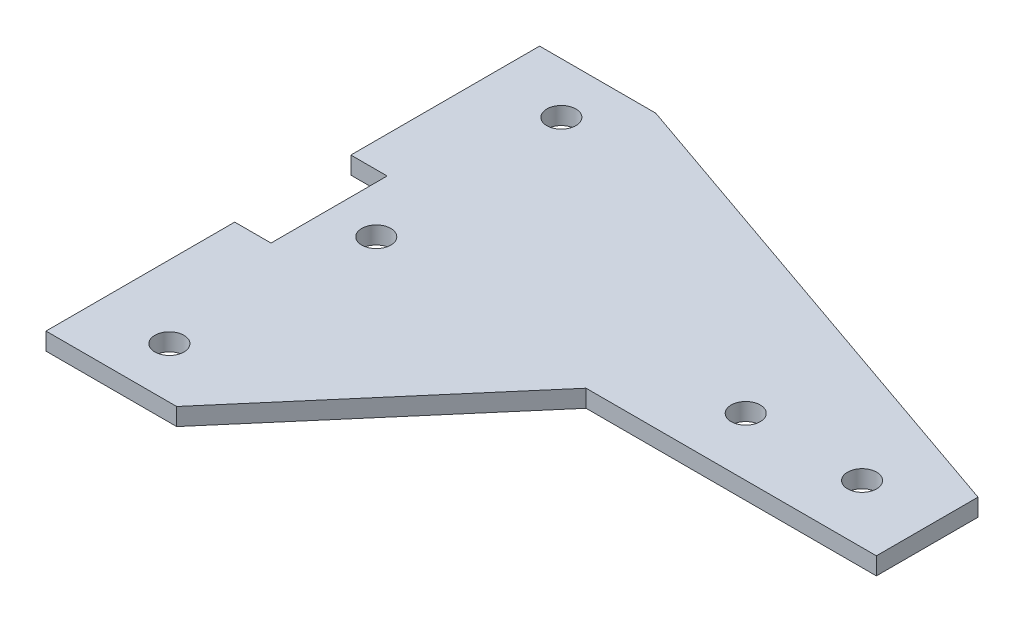
ISO-10303-21;
HEADER;
FILE_DESCRIPTION(('STEP AP214'),'2;1');
FILE_NAME('part.step','',(''),(''),'','','');
FILE_SCHEMA(('AUTOMOTIVE_DESIGN { 1 0 10303 214 1 1 1 1 }'));
ENDSEC;
DATA;
#1=APPLICATION_CONTEXT('core data for automotive mechanical design processes');
#2=APPLICATION_PROTOCOL_DEFINITION('international standard','automotive_design',2000,#1);
#3=PRODUCT_CONTEXT('',#1,'mechanical');
#4=PRODUCT('Part','Part','',(#3));
#5=PRODUCT_RELATED_PRODUCT_CATEGORY('part','',(#4));
#6=PRODUCT_DEFINITION_FORMATION('','',#4);
#7=PRODUCT_DEFINITION_CONTEXT('part definition',#1,'design');
#8=PRODUCT_DEFINITION('design','',#6,#7);
#9=PRODUCT_DEFINITION_SHAPE('','',#8);
#10=(LENGTH_UNIT() NAMED_UNIT(*) SI_UNIT(.MILLI.,.METRE.));
#11=(NAMED_UNIT(*) PLANE_ANGLE_UNIT() SI_UNIT($,.RADIAN.));
#12=(NAMED_UNIT(*) SI_UNIT($,.STERADIAN.) SOLID_ANGLE_UNIT());
#13=UNCERTAINTY_MEASURE_WITH_UNIT(LENGTH_MEASURE(1.E-05),#10,'distance_accuracy_value','');
#14=(GEOMETRIC_REPRESENTATION_CONTEXT(3) GLOBAL_UNCERTAINTY_ASSIGNED_CONTEXT((#13)) GLOBAL_UNIT_ASSIGNED_CONTEXT((#10,
#11,#12)) REPRESENTATION_CONTEXT('',''));
#15=CARTESIAN_POINT('',(0.,0.,0.));
#16=DIRECTION('',(0.,0.,1.));
#17=DIRECTION('',(1.,0.,0.));
#18=AXIS2_PLACEMENT_3D('',#15,#16,#17);
#19=CARTESIAN_POINT('',(0.,3.048,0.));
#20=DIRECTION('',(0.,-1.,0.));
#21=DIRECTION('',(0.,0.,-1.));
#22=AXIS2_PLACEMENT_3D('',#19,#20,#21);
#23=PLANE('',#22);
#24=DIRECTION('',(1.,0.,0.));
#25=VECTOR('',#24,1.);
#26=CARTESIAN_POINT('',(-6.35,3.048,-20.32));
#27=LINE('',#26,#25);
#28=CARTESIAN_POINT('',(-6.35,3.048,-20.32));
#29=VERTEX_POINT('',#28);
#30=CARTESIAN_POINT('',(0.,3.048,-20.32));
#31=VERTEX_POINT('',#30);
#32=EDGE_CURVE('E172',#29,#31,#27,.T.);
#33=ORIENTED_EDGE('',*,*,#32,.T.);
#34=DIRECTION('',(0.,0.,1.));
#35=VECTOR('',#34,1.);
#36=CARTESIAN_POINT('',(0.,3.048,-20.32));
#37=LINE('',#36,#35);
#38=CARTESIAN_POINT('',(0.,3.048,0.));
#39=VERTEX_POINT('',#38);
#40=EDGE_CURVE('E105',#31,#39,#37,.T.);
#41=ORIENTED_EDGE('',*,*,#40,.T.);
#42=DIRECTION('',(-1.,0.,0.));
#43=VECTOR('',#42,1.);
#44=CARTESIAN_POINT('',(0.,3.048,0.));
#45=LINE('',#44,#43);
#46=CARTESIAN_POINT('',(-6.35,3.048,0.));
#47=VERTEX_POINT('',#46);
#48=EDGE_CURVE('E196',#39,#47,#45,.T.);
#49=ORIENTED_EDGE('',*,*,#48,.T.);
#50=DIRECTION('',(0.,0.,1.));
#51=VECTOR('',#50,1.);
#52=CARTESIAN_POINT('',(-6.35,3.048,0.));
#53=LINE('',#52,#51);
#54=CARTESIAN_POINT('',(-6.34999999999999,3.048,33.02));
#55=VERTEX_POINT('',#54);
#56=EDGE_CURVE('E215',#47,#55,#53,.T.);
#57=ORIENTED_EDGE('',*,*,#56,.T.);
#58=DIRECTION('',(1.,0.,0.));
#59=VECTOR('',#58,1.);
#60=CARTESIAN_POINT('',(-6.34999999999999,3.048,33.02));
#61=LINE('',#60,#59);
#62=CARTESIAN_POINT('',(16.51,3.048,33.02));
#63=VERTEX_POINT('',#62);
#64=EDGE_CURVE('E212',#55,#63,#61,.T.);
#65=ORIENTED_EDGE('',*,*,#64,.T.);
#66=DIRECTION('',(0.650413169829219,0.,-0.759580613570875));
#67=VECTOR('',#66,1.);
#68=CARTESIAN_POINT('',(16.51,3.048,33.02));
#69=LINE('',#68,#67);
#70=CARTESIAN_POINT('',(49.5509890273243,3.048,-5.56669516940044));
#71=VERTEX_POINT('',#70);
#72=EDGE_CURVE('E214',#63,#71,#69,.T.);
#73=ORIENTED_EDGE('',*,*,#72,.T.);
#74=DIRECTION('',(1.,0.,0.));
#75=VECTOR('',#74,1.);
#76=CARTESIAN_POINT('',(49.5509890273243,3.048,-5.56669516940044));
#77=LINE('',#76,#75);
#78=CARTESIAN_POINT('',(100.350989027324,3.048,-5.56669516940044));
#79=VERTEX_POINT('',#78);
#80=EDGE_CURVE('E217',#71,#79,#77,.T.);
#81=ORIENTED_EDGE('',*,*,#80,.T.);
#82=DIRECTION('',(0.,0.,-1.));
#83=VECTOR('',#82,1.);
#84=CARTESIAN_POINT('',(100.350989027324,3.048,-5.56669516940044));
#85=LINE('',#84,#83);
#86=CARTESIAN_POINT('',(100.350989027324,3.048,-23.3466951694004));
#87=VERTEX_POINT('',#86);
#88=EDGE_CURVE('E133',#79,#87,#85,.T.);
#89=ORIENTED_EDGE('',*,*,#88,.T.);
#90=DIRECTION('',(-0.944673983238455,0.,-0.328010770238403));
#91=VECTOR('',#90,1.);
#92=CARTESIAN_POINT('',(13.97,3.048,-53.34));
#93=LINE('',#92,#91);
#94=CARTESIAN_POINT('',(13.97,3.048,-53.34));
#95=VERTEX_POINT('',#94);
#96=EDGE_CURVE('E127',#87,#95,#93,.T.);
#97=ORIENTED_EDGE('',*,*,#96,.T.);
#98=DIRECTION('',(-1.,0.,0.));
#99=VECTOR('',#98,1.);
#100=CARTESIAN_POINT('',(-6.35,3.048,-53.34));
#101=LINE('',#100,#99);
#102=CARTESIAN_POINT('',(-6.35,3.048,-53.34));
#103=VERTEX_POINT('',#102);
#104=EDGE_CURVE('E131',#95,#103,#101,.T.);
#105=ORIENTED_EDGE('',*,*,#104,.T.);
#106=DIRECTION('',(0.,0.,1.));
#107=VECTOR('',#106,1.);
#108=CARTESIAN_POINT('',(-6.35,3.048,-53.34));
#109=LINE('',#108,#107);
#110=EDGE_CURVE('E53',#103,#29,#109,.T.);
#111=ORIENTED_EDGE('',*,*,#110,.T.);
#112=EDGE_LOOP('',(#33,#41,#49,#57,#65,#73,#81,#89,#97,#105,#111));
#113=FACE_BOUND('',#112,.T.);
#114=CARTESIAN_POINT('',(87.6891837365436,3.048,-15.7266951694004));
#115=DIRECTION('',(0.,1.,0.));
#116=DIRECTION('',(0.,0.,1.));
#117=AXIS2_PLACEMENT_3D('',#114,#115,#116);
#118=CIRCLE('',#117,2.54);
#119=CARTESIAN_POINT('',(87.6891837365436,3.048,-13.1866951694004));
#120=VERTEX_POINT('',#119);
#121=EDGE_CURVE('E155',#120,#120,#118,.T.);
#122=ORIENTED_EDGE('',*,*,#121,.F.);
#123=EDGE_LOOP('',(#122));
#124=FACE_BOUND('',#123,.T.);
#125=CARTESIAN_POINT('',(8.255,3.048,-10.16));
#126=DIRECTION('',(0.,1.,0.));
#127=DIRECTION('',(0.,0.,1.));
#128=AXIS2_PLACEMENT_3D('',#125,#126,#127);
#129=CIRCLE('',#128,2.54);
#130=CARTESIAN_POINT('',(8.255,3.048,-7.62));
#131=VERTEX_POINT('',#130);
#132=EDGE_CURVE('E294',#131,#131,#129,.T.);
#133=ORIENTED_EDGE('',*,*,#132,.F.);
#134=EDGE_LOOP('',(#133));
#135=FACE_BOUND('',#134,.T.);
#136=CARTESIAN_POINT('',(6.35,3.048,24.13));
#137=DIRECTION('',(0.,1.,0.));
#138=DIRECTION('',(0.,0.,1.));
#139=AXIS2_PLACEMENT_3D('',#136,#137,#138);
#140=CIRCLE('',#139,2.54);
#141=CARTESIAN_POINT('',(6.35,3.048,26.67));
#142=VERTEX_POINT('',#141);
#143=EDGE_CURVE('E288',#142,#142,#140,.T.);
#144=ORIENTED_EDGE('',*,*,#143,.F.);
#145=EDGE_LOOP('',(#144));
#146=FACE_BOUND('',#145,.T.);
#147=CARTESIAN_POINT('',(6.34999999999999,3.048,-44.45));
#148=DIRECTION('',(0.,1.,0.));
#149=DIRECTION('',(0.,0.,1.));
#150=AXIS2_PLACEMENT_3D('',#147,#148,#149);
#151=CIRCLE('',#150,2.54);
#152=CARTESIAN_POINT('',(6.34999999999999,3.048,-41.91));
#153=VERTEX_POINT('',#152);
#154=EDGE_CURVE('E282',#153,#153,#151,.T.);
#155=ORIENTED_EDGE('',*,*,#154,.F.);
#156=EDGE_LOOP('',(#155));
#157=FACE_BOUND('',#156,.T.);
#158=CARTESIAN_POINT('',(67.3309890273243,3.048,-15.7266951694004));
#159=DIRECTION('',(0.,1.,0.));
#160=DIRECTION('',(0.,0.,1.));
#161=AXIS2_PLACEMENT_3D('',#158,#159,#160);
#162=CIRCLE('',#161,2.54);
#163=CARTESIAN_POINT('',(67.3309890273243,3.048,-13.1866951694004));
#164=VERTEX_POINT('',#163);
#165=EDGE_CURVE('E273',#164,#164,#162,.T.);
#166=ORIENTED_EDGE('',*,*,#165,.F.);
#167=EDGE_LOOP('',(#166));
#168=FACE_BOUND('',#167,.T.);
#169=ADVANCED_FACE('F36',(#113,#124,#135,#146,#157,#168),#23,.F.);
#170=CARTESIAN_POINT('',(0.,0.,0.));
#171=DIRECTION('',(0.,-1.,0.));
#172=DIRECTION('',(0.,0.,-1.));
#173=AXIS2_PLACEMENT_3D('',#170,#171,#172);
#174=PLANE('',#173);
#175=CARTESIAN_POINT('',(6.34999999999999,0.,-44.45));
#176=DIRECTION('',(0.,1.,0.));
#177=DIRECTION('',(0.,0.,1.));
#178=AXIS2_PLACEMENT_3D('',#175,#176,#177);
#179=CIRCLE('',#178,2.54);
#180=CARTESIAN_POINT('',(6.34999999999999,0.,-41.91));
#181=VERTEX_POINT('',#180);
#182=EDGE_CURVE('E279',#181,#181,#179,.T.);
#183=ORIENTED_EDGE('',*,*,#182,.T.);
#184=EDGE_LOOP('',(#183));
#185=FACE_BOUND('',#184,.T.);
#186=CARTESIAN_POINT('',(8.255,0.,-10.16));
#187=DIRECTION('',(0.,1.,0.));
#188=DIRECTION('',(0.,0.,1.));
#189=AXIS2_PLACEMENT_3D('',#186,#187,#188);
#190=CIRCLE('',#189,2.54);
#191=CARTESIAN_POINT('',(8.255,0.,-7.62));
#192=VERTEX_POINT('',#191);
#193=EDGE_CURVE('E291',#192,#192,#190,.T.);
#194=ORIENTED_EDGE('',*,*,#193,.T.);
#195=EDGE_LOOP('',(#194));
#196=FACE_BOUND('',#195,.T.);
#197=DIRECTION('',(1.,0.,0.));
#198=VECTOR('',#197,1.);
#199=CARTESIAN_POINT('',(-6.35,0.,-20.32));
#200=LINE('',#199,#198);
#201=CARTESIAN_POINT('',(-6.35,0.,-20.32));
#202=VERTEX_POINT('',#201);
#203=CARTESIAN_POINT('',(0.,0.,-20.32));
#204=VERTEX_POINT('',#203);
#205=EDGE_CURVE('E151',#202,#204,#200,.T.);
#206=ORIENTED_EDGE('',*,*,#205,.F.);
#207=DIRECTION('',(0.,0.,1.));
#208=VECTOR('',#207,1.);
#209=CARTESIAN_POINT('',(-6.35,0.,-53.34));
#210=LINE('',#209,#208);
#211=CARTESIAN_POINT('',(-6.35,0.,-53.34));
#212=VERTEX_POINT('',#211);
#213=EDGE_CURVE('E97',#212,#202,#210,.T.);
#214=ORIENTED_EDGE('',*,*,#213,.F.);
#215=DIRECTION('',(-1.,0.,0.));
#216=VECTOR('',#215,1.);
#217=CARTESIAN_POINT('',(-6.35,0.,-53.34));
#218=LINE('',#217,#216);
#219=CARTESIAN_POINT('',(13.97,0.,-53.34));
#220=VERTEX_POINT('',#219);
#221=EDGE_CURVE('E91',#220,#212,#218,.T.);
#222=ORIENTED_EDGE('',*,*,#221,.F.);
#223=DIRECTION('',(-0.944673983238455,0.,-0.328010770238403));
#224=VECTOR('',#223,1.);
#225=CARTESIAN_POINT('',(13.97,0.,-53.34));
#226=LINE('',#225,#224);
#227=CARTESIAN_POINT('',(100.350989027324,0.,-23.3466951694004));
#228=VERTEX_POINT('',#227);
#229=EDGE_CURVE('E141',#228,#220,#226,.T.);
#230=ORIENTED_EDGE('',*,*,#229,.F.);
#231=DIRECTION('',(0.,0.,-1.));
#232=VECTOR('',#231,1.);
#233=CARTESIAN_POINT('',(100.350989027324,0.,-5.56669516940044));
#234=LINE('',#233,#232);
#235=CARTESIAN_POINT('',(100.350989027324,0.,-5.56669516940044));
#236=VERTEX_POINT('',#235);
#237=EDGE_CURVE('E167',#236,#228,#234,.T.);
#238=ORIENTED_EDGE('',*,*,#237,.F.);
#239=DIRECTION('',(1.,0.,0.));
#240=VECTOR('',#239,1.);
#241=CARTESIAN_POINT('',(49.5509890273243,0.,-5.56669516940044));
#242=LINE('',#241,#240);
#243=CARTESIAN_POINT('',(49.5509890273243,0.,-5.56669516940044));
#244=VERTEX_POINT('',#243);
#245=EDGE_CURVE('E165',#244,#236,#242,.T.);
#246=ORIENTED_EDGE('',*,*,#245,.F.);
#247=DIRECTION('',(0.650413169829219,0.,-0.759580613570875));
#248=VECTOR('',#247,1.);
#249=CARTESIAN_POINT('',(16.51,0.,33.02));
#250=LINE('',#249,#248);
#251=CARTESIAN_POINT('',(16.51,0.,33.02));
#252=VERTEX_POINT('',#251);
#253=EDGE_CURVE('E163',#252,#244,#250,.T.);
#254=ORIENTED_EDGE('',*,*,#253,.F.);
#255=DIRECTION('',(1.,0.,0.));
#256=VECTOR('',#255,1.);
#257=CARTESIAN_POINT('',(-6.34999999999999,0.,33.02));
#258=LINE('',#257,#256);
#259=CARTESIAN_POINT('',(-6.34999999999999,0.,33.02));
#260=VERTEX_POINT('',#259);
#261=EDGE_CURVE('E161',#260,#252,#258,.T.);
#262=ORIENTED_EDGE('',*,*,#261,.F.);
#263=DIRECTION('',(0.,0.,1.));
#264=VECTOR('',#263,1.);
#265=CARTESIAN_POINT('',(-6.35,0.,0.));
#266=LINE('',#265,#264);
#267=CARTESIAN_POINT('',(-6.35,0.,0.));
#268=VERTEX_POINT('',#267);
#269=EDGE_CURVE('E159',#268,#260,#266,.T.);
#270=ORIENTED_EDGE('',*,*,#269,.F.);
#271=DIRECTION('',(-1.,0.,0.));
#272=VECTOR('',#271,1.);
#273=CARTESIAN_POINT('',(0.,0.,0.));
#274=LINE('',#273,#272);
#275=CARTESIAN_POINT('',(0.,0.,0.));
#276=VERTEX_POINT('',#275);
#277=EDGE_CURVE('E157',#276,#268,#274,.T.);
#278=ORIENTED_EDGE('',*,*,#277,.F.);
#279=DIRECTION('',(0.,0.,1.));
#280=VECTOR('',#279,1.);
#281=CARTESIAN_POINT('',(0.,0.,-20.32));
#282=LINE('',#281,#280);
#283=EDGE_CURVE('E154',#204,#276,#282,.T.);
#284=ORIENTED_EDGE('',*,*,#283,.F.);
#285=EDGE_LOOP('',(#206,#214,#222,#230,#238,#246,#254,#262,#270,#278,#284));
#286=FACE_BOUND('',#285,.T.);
#287=CARTESIAN_POINT('',(87.6891837365436,0.,-15.7266951694004));
#288=DIRECTION('',(0.,1.,0.));
#289=DIRECTION('',(0.,0.,1.));
#290=AXIS2_PLACEMENT_3D('',#287,#288,#289);
#291=CIRCLE('',#290,2.54);
#292=CARTESIAN_POINT('',(87.6891837365436,0.,-13.1866951694004));
#293=VERTEX_POINT('',#292);
#294=EDGE_CURVE('E297',#293,#293,#291,.T.);
#295=ORIENTED_EDGE('',*,*,#294,.T.);
#296=EDGE_LOOP('',(#295));
#297=FACE_BOUND('',#296,.T.);
#298=CARTESIAN_POINT('',(6.35,0.,24.13));
#299=DIRECTION('',(0.,1.,0.));
#300=DIRECTION('',(0.,0.,1.));
#301=AXIS2_PLACEMENT_3D('',#298,#299,#300);
#302=CIRCLE('',#301,2.54);
#303=CARTESIAN_POINT('',(6.35,0.,26.67));
#304=VERTEX_POINT('',#303);
#305=EDGE_CURVE('E285',#304,#304,#302,.T.);
#306=ORIENTED_EDGE('',*,*,#305,.T.);
#307=EDGE_LOOP('',(#306));
#308=FACE_BOUND('',#307,.T.);
#309=CARTESIAN_POINT('',(67.3309890273243,0.,-15.7266951694004));
#310=DIRECTION('',(0.,1.,0.));
#311=DIRECTION('',(0.,0.,1.));
#312=AXIS2_PLACEMENT_3D('',#309,#310,#311);
#313=CIRCLE('',#312,2.54);
#314=CARTESIAN_POINT('',(67.3309890273243,0.,-13.1866951694004));
#315=VERTEX_POINT('',#314);
#316=EDGE_CURVE('E276',#315,#315,#313,.T.);
#317=ORIENTED_EDGE('',*,*,#316,.T.);
#318=EDGE_LOOP('',(#317));
#319=FACE_BOUND('',#318,.T.);
#320=ADVANCED_FACE('F200',(#185,#196,#286,#297,#308,#319),#174,.T.);
#321=CARTESIAN_POINT('',(-6.35,3.048,-20.32));
#322=DIRECTION('',(0.,0.,-1.));
#323=DIRECTION('',(-1.,0.,0.));
#324=AXIS2_PLACEMENT_3D('',#321,#322,#323);
#325=PLANE('',#324);
#326=ORIENTED_EDGE('',*,*,#205,.T.);
#327=DIRECTION('',(0.,-1.,0.));
#328=VECTOR('',#327,1.);
#329=CARTESIAN_POINT('',(0.,3.048,-20.32));
#330=LINE('',#329,#328);
#331=EDGE_CURVE('E11',#31,#204,#330,.T.);
#332=ORIENTED_EDGE('',*,*,#331,.F.);
#333=ORIENTED_EDGE('',*,*,#32,.F.);
#334=DIRECTION('',(0.,-1.,0.));
#335=VECTOR('',#334,1.);
#336=CARTESIAN_POINT('',(-6.35,3.048,-20.32));
#337=LINE('',#336,#335);
#338=EDGE_CURVE('E147',#29,#202,#337,.T.);
#339=ORIENTED_EDGE('',*,*,#338,.T.);
#340=EDGE_LOOP('',(#326,#332,#333,#339));
#341=FACE_BOUND('',#340,.T.);
#342=ADVANCED_FACE('F38',(#341),#325,.F.);
#343=CARTESIAN_POINT('',(0.,3.048,-20.32));
#344=DIRECTION('',(1.,0.,0.));
#345=DIRECTION('',(0.,0.,-1.));
#346=AXIS2_PLACEMENT_3D('',#343,#344,#345);
#347=PLANE('',#346);
#348=ORIENTED_EDGE('',*,*,#283,.T.);
#349=DIRECTION('',(0.,-1.,0.));
#350=VECTOR('',#349,1.);
#351=CARTESIAN_POINT('',(0.,3.048,0.));
#352=LINE('',#351,#350);
#353=EDGE_CURVE('E45',#39,#276,#352,.T.);
#354=ORIENTED_EDGE('',*,*,#353,.F.);
#355=ORIENTED_EDGE('',*,*,#40,.F.);
#356=ORIENTED_EDGE('',*,*,#331,.T.);
#357=EDGE_LOOP('',(#348,#354,#355,#356));
#358=FACE_BOUND('',#357,.T.);
#359=ADVANCED_FACE('F408',(#358),#347,.F.);
#360=CARTESIAN_POINT('',(0.,3.048,0.));
#361=DIRECTION('',(0.,0.,1.));
#362=DIRECTION('',(1.,0.,0.));
#363=AXIS2_PLACEMENT_3D('',#360,#361,#362);
#364=PLANE('',#363);
#365=ORIENTED_EDGE('',*,*,#277,.T.);
#366=DIRECTION('',(0.,-1.,0.));
#367=VECTOR('',#366,1.);
#368=CARTESIAN_POINT('',(-6.35,3.048,0.));
#369=LINE('',#368,#367);
#370=EDGE_CURVE('E188',#47,#268,#369,.T.);
#371=ORIENTED_EDGE('',*,*,#370,.F.);
#372=ORIENTED_EDGE('',*,*,#48,.F.);
#373=ORIENTED_EDGE('',*,*,#353,.T.);
#374=EDGE_LOOP('',(#365,#371,#372,#373));
#375=FACE_BOUND('',#374,.T.);
#376=ADVANCED_FACE('F194',(#375),#364,.F.);
#377=CARTESIAN_POINT('',(-6.35,3.048,0.));
#378=DIRECTION('',(1.,0.,0.));
#379=DIRECTION('',(0.,0.,-1.));
#380=AXIS2_PLACEMENT_3D('',#377,#378,#379);
#381=PLANE('',#380);
#382=ORIENTED_EDGE('',*,*,#269,.T.);
#383=DIRECTION('',(0.,-1.,0.));
#384=VECTOR('',#383,1.);
#385=CARTESIAN_POINT('',(-6.34999999999999,3.048,33.02));
#386=LINE('',#385,#384);
#387=EDGE_CURVE('E185',#55,#260,#386,.T.);
#388=ORIENTED_EDGE('',*,*,#387,.F.);
#389=ORIENTED_EDGE('',*,*,#56,.F.);
#390=ORIENTED_EDGE('',*,*,#370,.T.);
#391=EDGE_LOOP('',(#382,#388,#389,#390));
#392=FACE_BOUND('',#391,.T.);
#393=ADVANCED_FACE('F206',(#392),#381,.F.);
#394=CARTESIAN_POINT('',(-6.34999999999999,3.048,33.02));
#395=DIRECTION('',(0.,0.,-1.));
#396=DIRECTION('',(-1.,0.,0.));
#397=AXIS2_PLACEMENT_3D('',#394,#395,#396);
#398=PLANE('',#397);
#399=ORIENTED_EDGE('',*,*,#261,.T.);
#400=DIRECTION('',(0.,-1.,0.));
#401=VECTOR('',#400,1.);
#402=CARTESIAN_POINT('',(16.51,3.048,33.02));
#403=LINE('',#402,#401);
#404=EDGE_CURVE('E182',#63,#252,#403,.T.);
#405=ORIENTED_EDGE('',*,*,#404,.F.);
#406=ORIENTED_EDGE('',*,*,#64,.F.);
#407=ORIENTED_EDGE('',*,*,#387,.T.);
#408=EDGE_LOOP('',(#399,#405,#406,#407));
#409=FACE_BOUND('',#408,.T.);
#410=ADVANCED_FACE('F210',(#409),#398,.F.);
#411=CARTESIAN_POINT('',(16.51,3.048,33.02));
#412=DIRECTION('',(-0.759580613570875,0.,-0.650413169829219));
#413=DIRECTION('',(-0.650413169829219,0.,0.759580613570875));
#414=AXIS2_PLACEMENT_3D('',#411,#412,#413);
#415=PLANE('',#414);
#416=ORIENTED_EDGE('',*,*,#253,.T.);
#417=DIRECTION('',(0.,-1.,0.));
#418=VECTOR('',#417,1.);
#419=CARTESIAN_POINT('',(49.5509890273243,3.048,-5.56669516940044));
#420=LINE('',#419,#418);
#421=EDGE_CURVE('E179',#71,#244,#420,.T.);
#422=ORIENTED_EDGE('',*,*,#421,.F.);
#423=ORIENTED_EDGE('',*,*,#72,.F.);
#424=ORIENTED_EDGE('',*,*,#404,.T.);
#425=EDGE_LOOP('',(#416,#422,#423,#424));
#426=FACE_BOUND('',#425,.T.);
#427=ADVANCED_FACE('F374',(#426),#415,.F.);
#428=CARTESIAN_POINT('',(49.5509890273243,3.048,-5.56669516940044));
#429=DIRECTION('',(0.,0.,-1.));
#430=DIRECTION('',(-1.,0.,0.));
#431=AXIS2_PLACEMENT_3D('',#428,#429,#430);
#432=PLANE('',#431);
#433=ORIENTED_EDGE('',*,*,#245,.T.);
#434=DIRECTION('',(0.,-1.,0.));
#435=VECTOR('',#434,1.);
#436=CARTESIAN_POINT('',(100.350989027324,3.048,-5.56669516940044));
#437=LINE('',#436,#435);
#438=EDGE_CURVE('E176',#79,#236,#437,.T.);
#439=ORIENTED_EDGE('',*,*,#438,.F.);
#440=ORIENTED_EDGE('',*,*,#80,.F.);
#441=ORIENTED_EDGE('',*,*,#421,.T.);
#442=EDGE_LOOP('',(#433,#439,#440,#441));
#443=FACE_BOUND('',#442,.T.);
#444=ADVANCED_FACE('F226',(#443),#432,.F.);
#445=CARTESIAN_POINT('',(100.350989027324,3.048,-5.56669516940044));
#446=DIRECTION('',(-1.,0.,0.));
#447=DIRECTION('',(0.,0.,1.));
#448=AXIS2_PLACEMENT_3D('',#445,#446,#447);
#449=PLANE('',#448);
#450=ORIENTED_EDGE('',*,*,#237,.T.);
#451=DIRECTION('',(0.,-1.,0.));
#452=VECTOR('',#451,1.);
#453=CARTESIAN_POINT('',(100.350989027324,3.048,-23.3466951694004));
#454=LINE('',#453,#452);
#455=EDGE_CURVE('E142',#87,#228,#454,.T.);
#456=ORIENTED_EDGE('',*,*,#455,.F.);
#457=ORIENTED_EDGE('',*,*,#88,.F.);
#458=ORIENTED_EDGE('',*,*,#438,.T.);
#459=EDGE_LOOP('',(#450,#456,#457,#458));
#460=FACE_BOUND('',#459,.T.);
#461=ADVANCED_FACE('F230',(#460),#449,.F.);
#462=CARTESIAN_POINT('',(13.97,3.048,-53.34));
#463=DIRECTION('',(-0.328010770238403,0.,0.944673983238455));
#464=DIRECTION('',(0.944673983238456,0.,0.328010770238403));
#465=AXIS2_PLACEMENT_3D('',#462,#463,#464);
#466=PLANE('',#465);
#467=ORIENTED_EDGE('',*,*,#229,.T.);
#468=DIRECTION('',(0.,-1.,0.));
#469=VECTOR('',#468,1.);
#470=CARTESIAN_POINT('',(13.97,3.048,-53.34));
#471=LINE('',#470,#469);
#472=EDGE_CURVE('E138',#95,#220,#471,.T.);
#473=ORIENTED_EDGE('',*,*,#472,.F.);
#474=ORIENTED_EDGE('',*,*,#96,.F.);
#475=ORIENTED_EDGE('',*,*,#455,.T.);
#476=EDGE_LOOP('',(#467,#473,#474,#475));
#477=FACE_BOUND('',#476,.T.);
#478=ADVANCED_FACE('F139',(#477),#466,.F.);
#479=CARTESIAN_POINT('',(-6.35,3.048,-53.34));
#480=DIRECTION('',(0.,0.,1.));
#481=DIRECTION('',(1.,0.,0.));
#482=AXIS2_PLACEMENT_3D('',#479,#480,#481);
#483=PLANE('',#482);
#484=ORIENTED_EDGE('',*,*,#221,.T.);
#485=DIRECTION('',(0.,-1.,0.));
#486=VECTOR('',#485,1.);
#487=CARTESIAN_POINT('',(-6.35,3.048,-53.34));
#488=LINE('',#487,#486);
#489=EDGE_CURVE('E143',#103,#212,#488,.T.);
#490=ORIENTED_EDGE('',*,*,#489,.F.);
#491=ORIENTED_EDGE('',*,*,#104,.F.);
#492=ORIENTED_EDGE('',*,*,#472,.T.);
#493=EDGE_LOOP('',(#484,#490,#491,#492));
#494=FACE_BOUND('',#493,.T.);
#495=ADVANCED_FACE('F145',(#494),#483,.F.);
#496=CARTESIAN_POINT('',(-6.35,3.048,-53.34));
#497=DIRECTION('',(1.,0.,0.));
#498=DIRECTION('',(0.,0.,-1.));
#499=AXIS2_PLACEMENT_3D('',#496,#497,#498);
#500=PLANE('',#499);
#501=ORIENTED_EDGE('',*,*,#213,.T.);
#502=ORIENTED_EDGE('',*,*,#338,.F.);
#503=ORIENTED_EDGE('',*,*,#110,.F.);
#504=ORIENTED_EDGE('',*,*,#489,.T.);
#505=EDGE_LOOP('',(#501,#502,#503,#504));
#506=FACE_BOUND('',#505,.T.);
#507=ADVANCED_FACE('F234',(#506),#500,.F.);
#508=CARTESIAN_POINT('',(87.6891837365436,3.048,-15.7266951694004));
#509=DIRECTION('',(0.,-1.,0.));
#510=DIRECTION('',(0.,0.,-1.));
#511=AXIS2_PLACEMENT_3D('',#508,#509,#510);
#512=CYLINDRICAL_SURFACE('',#511,2.54);
#513=ORIENTED_EDGE('',*,*,#121,.T.);
#514=EDGE_LOOP('',(#513));
#515=FACE_BOUND('',#514,.T.);
#516=ORIENTED_EDGE('',*,*,#294,.F.);
#517=EDGE_LOOP('',(#516));
#518=FACE_BOUND('',#517,.T.);
#519=ADVANCED_FACE('F236',(#515,#518),#512,.F.);
#520=CARTESIAN_POINT('',(8.255,3.048,-10.16));
#521=DIRECTION('',(0.,-1.,0.));
#522=DIRECTION('',(0.,0.,-1.));
#523=AXIS2_PLACEMENT_3D('',#520,#521,#522);
#524=CYLINDRICAL_SURFACE('',#523,2.54);
#525=ORIENTED_EDGE('',*,*,#132,.T.);
#526=EDGE_LOOP('',(#525));
#527=FACE_BOUND('',#526,.T.);
#528=ORIENTED_EDGE('',*,*,#193,.F.);
#529=EDGE_LOOP('',(#528));
#530=FACE_BOUND('',#529,.T.);
#531=ADVANCED_FACE('F242',(#527,#530),#524,.F.);
#532=CARTESIAN_POINT('',(6.35,3.048,24.13));
#533=DIRECTION('',(0.,-1.,0.));
#534=DIRECTION('',(0.,0.,-1.));
#535=AXIS2_PLACEMENT_3D('',#532,#533,#534);
#536=CYLINDRICAL_SURFACE('',#535,2.54);
#537=ORIENTED_EDGE('',*,*,#143,.T.);
#538=EDGE_LOOP('',(#537));
#539=FACE_BOUND('',#538,.T.);
#540=ORIENTED_EDGE('',*,*,#305,.F.);
#541=EDGE_LOOP('',(#540));
#542=FACE_BOUND('',#541,.T.);
#543=ADVANCED_FACE('F256',(#539,#542),#536,.F.);
#544=CARTESIAN_POINT('',(6.34999999999999,3.048,-44.45));
#545=DIRECTION('',(0.,-1.,0.));
#546=DIRECTION('',(0.,0.,-1.));
#547=AXIS2_PLACEMENT_3D('',#544,#545,#546);
#548=CYLINDRICAL_SURFACE('',#547,2.54);
#549=ORIENTED_EDGE('',*,*,#154,.T.);
#550=EDGE_LOOP('',(#549));
#551=FACE_BOUND('',#550,.T.);
#552=ORIENTED_EDGE('',*,*,#182,.F.);
#553=EDGE_LOOP('',(#552));
#554=FACE_BOUND('',#553,.T.);
#555=ADVANCED_FACE('F260',(#551,#554),#548,.F.);
#556=CARTESIAN_POINT('',(67.3309890273243,3.048,-15.7266951694004));
#557=DIRECTION('',(0.,-1.,0.));
#558=DIRECTION('',(0.,0.,-1.));
#559=AXIS2_PLACEMENT_3D('',#556,#557,#558);
#560=CYLINDRICAL_SURFACE('',#559,2.54);
#561=ORIENTED_EDGE('',*,*,#165,.T.);
#562=EDGE_LOOP('',(#561));
#563=FACE_BOUND('',#562,.T.);
#564=ORIENTED_EDGE('',*,*,#316,.F.);
#565=EDGE_LOOP('',(#564));
#566=FACE_BOUND('',#565,.T.);
#567=ADVANCED_FACE('F264',(#563,#566),#560,.F.);
#568=CLOSED_SHELL('',(#169,#320,#342,#359,#376,#393,#410,#427,#444,#461,#478,#495,#507,#519,
#531,#543,#555,#567));
#569=MANIFOLD_SOLID_BREP('B2',#568);
#570=ADVANCED_BREP_SHAPE_REPRESENTATION('',(#18,#569),#14);
#571=SHAPE_DEFINITION_REPRESENTATION(#9,#570);
ENDSEC;
END-ISO-10303-21;
